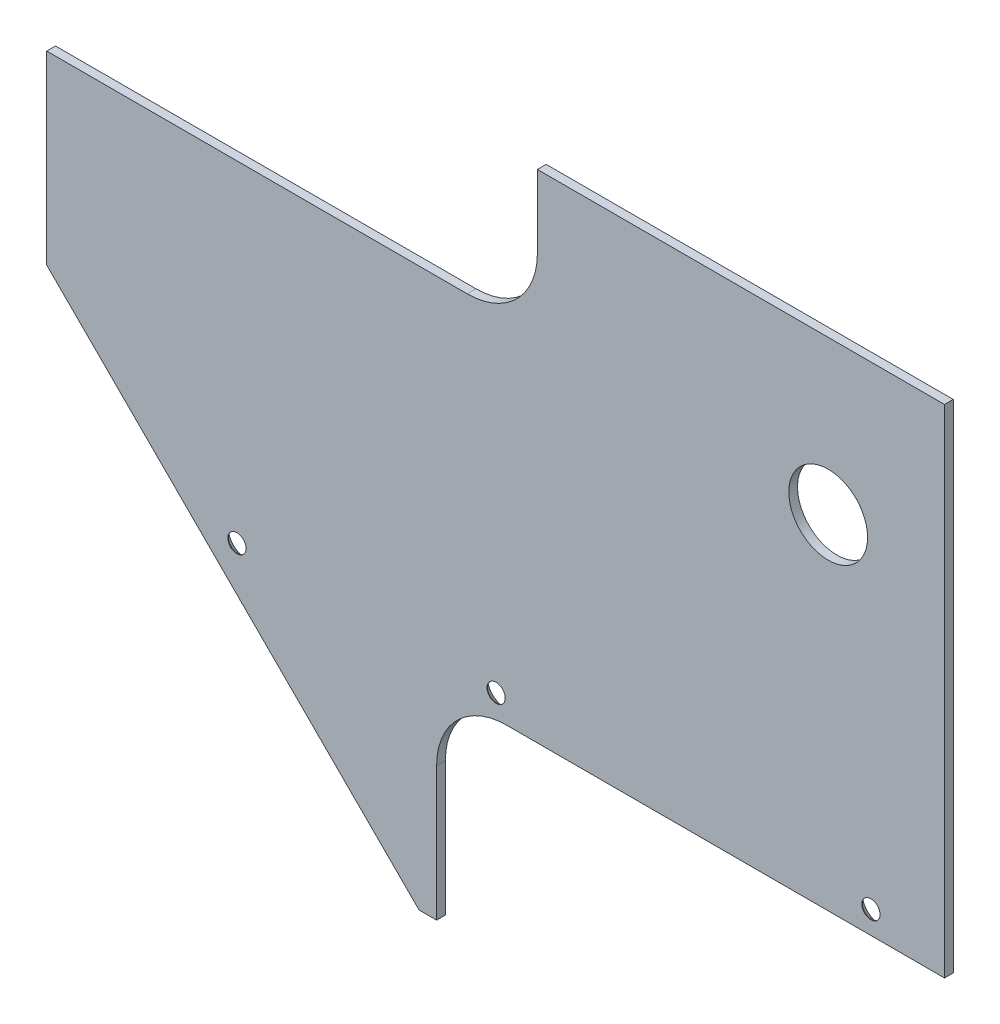
ISO-10303-21;
HEADER;
FILE_DESCRIPTION(('STEP AP214'),'2;1');
FILE_NAME('part.step','',(''),(''),'','','');
FILE_SCHEMA(('AUTOMOTIVE_DESIGN { 1 0 10303 214 1 1 1 1 }'));
ENDSEC;
DATA;
#1=APPLICATION_CONTEXT('core data for automotive mechanical design processes');
#2=APPLICATION_PROTOCOL_DEFINITION('international standard','automotive_design',2000,#1);
#3=PRODUCT_CONTEXT('',#1,'mechanical');
#4=PRODUCT('Part','Part','',(#3));
#5=PRODUCT_RELATED_PRODUCT_CATEGORY('part','',(#4));
#6=PRODUCT_DEFINITION_FORMATION('','',#4);
#7=PRODUCT_DEFINITION_CONTEXT('part definition',#1,'design');
#8=PRODUCT_DEFINITION('design','',#6,#7);
#9=PRODUCT_DEFINITION_SHAPE('','',#8);
#10=(LENGTH_UNIT() NAMED_UNIT(*) SI_UNIT(.MILLI.,.METRE.));
#11=(NAMED_UNIT(*) PLANE_ANGLE_UNIT() SI_UNIT($,.RADIAN.));
#12=(NAMED_UNIT(*) SI_UNIT($,.STERADIAN.) SOLID_ANGLE_UNIT());
#13=UNCERTAINTY_MEASURE_WITH_UNIT(LENGTH_MEASURE(1.E-05),#10,'distance_accuracy_value','');
#14=(GEOMETRIC_REPRESENTATION_CONTEXT(3) GLOBAL_UNCERTAINTY_ASSIGNED_CONTEXT((#13)) GLOBAL_UNIT_ASSIGNED_CONTEXT((#10,
#11,#12)) REPRESENTATION_CONTEXT('',''));
#15=CARTESIAN_POINT('',(0.,0.,0.));
#16=DIRECTION('',(0.,0.,1.));
#17=DIRECTION('',(1.,0.,0.));
#18=AXIS2_PLACEMENT_3D('',#15,#16,#17);
#19=CARTESIAN_POINT('',(0.,0.,3.175));
#20=DIRECTION('',(0.,0.,-1.));
#21=DIRECTION('',(-1.,0.,0.));
#22=AXIS2_PLACEMENT_3D('',#19,#20,#21);
#23=PLANE('',#22);
#24=CARTESIAN_POINT('',(196.040627804405,-39.3145242569452,3.175));
#25=DIRECTION('',(0.,0.,-1.));
#26=DIRECTION('',(-1.,0.,0.));
#27=AXIS2_PLACEMENT_3D('',#24,#25,#26);
#28=CIRCLE('',#27,3.3);
#29=CARTESIAN_POINT('',(192.740627804405,-39.3145242569452,3.175));
#30=VERTEX_POINT('',#29);
#31=EDGE_CURVE('E293',#30,#30,#28,.T.);
#32=ORIENTED_EDGE('',*,*,#31,.T.);
#33=EDGE_LOOP('',(#32));
#34=FACE_BOUND('',#33,.T.);
#35=CARTESIAN_POINT('',(60.1506278044051,-39.3145242569452,3.175));
#36=DIRECTION('',(0.,0.,-1.));
#37=DIRECTION('',(-1.,0.,0.));
#38=AXIS2_PLACEMENT_3D('',#35,#36,#37);
#39=CIRCLE('',#38,3.3);
#40=CARTESIAN_POINT('',(56.8506278044051,-39.3145242569452,3.175));
#41=VERTEX_POINT('',#40);
#42=EDGE_CURVE('E301',#41,#41,#39,.T.);
#43=ORIENTED_EDGE('',*,*,#42,.T.);
#44=EDGE_LOOP('',(#43));
#45=FACE_BOUND('',#44,.T.);
#46=CARTESIAN_POINT('',(-33.8293721955949,-39.3145242569452,3.175));
#47=DIRECTION('',(0.,0.,-1.));
#48=DIRECTION('',(-1.,0.,0.));
#49=AXIS2_PLACEMENT_3D('',#46,#47,#48);
#50=CIRCLE('',#49,3.3);
#51=CARTESIAN_POINT('',(-37.1293721955949,-39.3145242569452,3.175));
#52=VERTEX_POINT('',#51);
#53=EDGE_CURVE('E235',#52,#52,#50,.T.);
#54=ORIENTED_EDGE('',*,*,#53,.T.);
#55=EDGE_LOOP('',(#54));
#56=FACE_BOUND('',#55,.T.);
#57=CARTESIAN_POINT('',(180.538014077677,76.8319757430551,3.175));
#58=DIRECTION('',(0.,0.,1.));
#59=DIRECTION('',(1.,0.,0.));
#60=AXIS2_PLACEMENT_3D('',#57,#58,#59);
#61=CIRCLE('',#60,14.2875);
#62=CARTESIAN_POINT('',(194.825514077677,76.8319757430551,3.175));
#63=VERTEX_POINT('',#62);
#64=EDGE_CURVE('E141',#63,#63,#61,.T.);
#65=ORIENTED_EDGE('',*,*,#64,.F.);
#66=EDGE_LOOP('',(#65));
#67=FACE_BOUND('',#66,.T.);
#68=DIRECTION('',(1.,0.,0.));
#69=VECTOR('',#68,1.);
#70=CARTESIAN_POINT('',(-138.259383473898,80.7414870213568,3.175));
#71=LINE('',#70,#69);
#72=CARTESIAN_POINT('',(-102.790372195595,80.7414870213568,3.175));
#73=VERTEX_POINT('',#72);
#74=CARTESIAN_POINT('',(49.7006165261018,80.7414870213568,3.175));
#75=VERTEX_POINT('',#74);
#76=EDGE_CURVE('E190',#73,#75,#71,.T.);
#77=ORIENTED_EDGE('',*,*,#76,.F.);
#78=DIRECTION('',(0.,1.,0.));
#79=VECTOR('',#78,1.);
#80=CARTESIAN_POINT('',(-102.790372195595,87.7510097784921,3.175));
#81=LINE('',#80,#79);
#82=CARTESIAN_POINT('',(-102.790372195595,13.5224757430543,3.175));
#83=VERTEX_POINT('',#82);
#84=EDGE_CURVE('E48',#83,#73,#81,.T.);
#85=ORIENTED_EDGE('',*,*,#84,.F.);
#86=DIRECTION('',(0.707106781186546,-0.707106781186549,0.));
#87=VECTOR('',#86,1.);
#88=CARTESIAN_POINT('',(-138.259383473896,48.9914870213584,3.175));
#89=LINE('',#88,#87);
#90=CARTESIAN_POINT('',(32.2106278044069,-121.478524256945,3.175));
#91=VERTEX_POINT('',#90);
#92=EDGE_CURVE('E127',#83,#91,#89,.T.);
#93=ORIENTED_EDGE('',*,*,#92,.T.);
#94=DIRECTION('',(1.,0.,0.));
#95=VECTOR('',#94,1.);
#96=CARTESIAN_POINT('',(32.2106278044069,-121.478524256945,3.175));
#97=LINE('',#96,#95);
#98=CARTESIAN_POINT('',(38.5606278044052,-121.478524256945,3.175));
#99=VERTEX_POINT('',#98);
#100=EDGE_CURVE('E148',#91,#99,#97,.T.);
#101=ORIENTED_EDGE('',*,*,#100,.T.);
#102=DIRECTION('',(0.,1.,0.));
#103=VECTOR('',#102,1.);
#104=CARTESIAN_POINT('',(38.5606278044052,-121.478524256947,3.175));
#105=LINE('',#104,#103);
#106=CARTESIAN_POINT('',(38.5606278044053,-72.9645242569452,3.175));
#107=VERTEX_POINT('',#106);
#108=EDGE_CURVE('E185',#99,#107,#105,.T.);
#109=ORIENTED_EDGE('',*,*,#108,.T.);
#110=CARTESIAN_POINT('',(63.9606278044052,-72.9645242569452,3.175));
#111=DIRECTION('',(0.,0.,-1.));
#112=DIRECTION('',(-1.,0.,0.));
#113=AXIS2_PLACEMENT_3D('',#110,#111,#112);
#114=CIRCLE('',#113,25.4);
#115=CARTESIAN_POINT('',(63.9606278044053,-47.5645242569452,3.175));
#116=VERTEX_POINT('',#115);
#117=EDGE_CURVE('E156',#107,#116,#114,.T.);
#118=ORIENTED_EDGE('',*,*,#117,.T.);
#119=DIRECTION('',(-1.,0.,0.));
#120=VECTOR('',#119,1.);
#121=CARTESIAN_POINT('',(222.763434162284,-47.5645242569452,3.175));
#122=LINE('',#121,#120);
#123=CARTESIAN_POINT('',(222.710627804405,-47.5645242569452,3.175));
#124=VERTEX_POINT('',#123);
#125=EDGE_CURVE('E182',#124,#116,#122,.T.);
#126=ORIENTED_EDGE('',*,*,#125,.F.);
#127=DIRECTION('',(0.,1.,0.));
#128=VECTOR('',#127,1.);
#129=CARTESIAN_POINT('',(222.710627804405,-121.478524256948,3.175));
#130=LINE('',#129,#128);
#131=CARTESIAN_POINT('',(222.710627804405,132.521475743053,3.175));
#132=VERTEX_POINT('',#131);
#133=EDGE_CURVE('E138',#124,#132,#130,.T.);
#134=ORIENTED_EDGE('',*,*,#133,.T.);
#135=DIRECTION('',(1.,0.,0.));
#136=VECTOR('',#135,1.);
#137=CARTESIAN_POINT('',(75.1006165261018,132.521475743053,3.175));
#138=LINE('',#137,#136);
#139=CARTESIAN_POINT('',(75.1006165261018,132.521475743053,3.175));
#140=VERTEX_POINT('',#139);
#141=EDGE_CURVE('E233',#140,#132,#138,.T.);
#142=ORIENTED_EDGE('',*,*,#141,.F.);
#143=DIRECTION('',(0.,-1.,0.));
#144=VECTOR('',#143,1.);
#145=CARTESIAN_POINT('',(75.1006165261018,145.221475743053,3.175));
#146=LINE('',#145,#144);
#147=CARTESIAN_POINT('',(75.1006165261018,106.141487021357,3.175));
#148=VERTEX_POINT('',#147);
#149=EDGE_CURVE('E180',#140,#148,#146,.T.);
#150=ORIENTED_EDGE('',*,*,#149,.T.);
#151=CARTESIAN_POINT('',(49.7006165261018,106.141487021357,3.175));
#152=DIRECTION('',(0.,0.,-1.));
#153=DIRECTION('',(-1.,0.,0.));
#154=AXIS2_PLACEMENT_3D('',#151,#152,#153);
#155=CIRCLE('',#154,25.4);
#156=EDGE_CURVE('E166',#148,#75,#155,.T.);
#157=ORIENTED_EDGE('',*,*,#156,.T.);
#158=EDGE_LOOP('',(#77,#85,#93,#101,#109,#118,#126,#134,#142,#150,#157));
#159=FACE_BOUND('',#158,.T.);
#160=ADVANCED_FACE('F33',(#34,#45,#56,#67,#159),#23,.F.);
#161=CARTESIAN_POINT('',(0.,0.,0.));
#162=DIRECTION('',(0.,0.,-1.));
#163=DIRECTION('',(-1.,0.,0.));
#164=AXIS2_PLACEMENT_3D('',#161,#162,#163);
#165=PLANE('',#164);
#166=DIRECTION('',(0.,1.,0.));
#167=VECTOR('',#166,1.);
#168=CARTESIAN_POINT('',(-102.790372195595,87.7510097784921,0.));
#169=LINE('',#168,#167);
#170=CARTESIAN_POINT('',(-102.790372195595,13.5224757430543,0.));
#171=VERTEX_POINT('',#170);
#172=CARTESIAN_POINT('',(-102.790372195595,80.7414870213568,0.));
#173=VERTEX_POINT('',#172);
#174=EDGE_CURVE('E113',#171,#173,#169,.T.);
#175=ORIENTED_EDGE('',*,*,#174,.T.);
#176=DIRECTION('',(1.,0.,0.));
#177=VECTOR('',#176,1.);
#178=CARTESIAN_POINT('',(-138.259383473898,80.7414870213568,0.));
#179=LINE('',#178,#177);
#180=CARTESIAN_POINT('',(49.7006165261018,80.7414870213568,0.));
#181=VERTEX_POINT('',#180);
#182=EDGE_CURVE('E173',#173,#181,#179,.T.);
#183=ORIENTED_EDGE('',*,*,#182,.T.);
#184=CARTESIAN_POINT('',(49.7006165261018,106.141487021357,0.));
#185=DIRECTION('',(0.,0.,-1.));
#186=DIRECTION('',(-1.,0.,0.));
#187=AXIS2_PLACEMENT_3D('',#184,#185,#186);
#188=CIRCLE('',#187,25.4);
#189=CARTESIAN_POINT('',(75.1006165261018,106.141487021357,0.));
#190=VERTEX_POINT('',#189);
#191=EDGE_CURVE('E41',#181,#190,#188,.F.);
#192=ORIENTED_EDGE('',*,*,#191,.T.);
#193=DIRECTION('',(0.,-1.,0.));
#194=VECTOR('',#193,1.);
#195=CARTESIAN_POINT('',(75.1006165261018,145.221475743053,0.));
#196=LINE('',#195,#194);
#197=CARTESIAN_POINT('',(75.1006165261018,132.521475743053,0.));
#198=VERTEX_POINT('',#197);
#199=EDGE_CURVE('E172',#198,#190,#196,.T.);
#200=ORIENTED_EDGE('',*,*,#199,.F.);
#201=DIRECTION('',(1.,0.,0.));
#202=VECTOR('',#201,1.);
#203=CARTESIAN_POINT('',(75.1006165261018,132.521475743053,0.));
#204=LINE('',#203,#202);
#205=CARTESIAN_POINT('',(222.710627804405,132.521475743053,0.));
#206=VERTEX_POINT('',#205);
#207=EDGE_CURVE('E55',#198,#206,#204,.T.);
#208=ORIENTED_EDGE('',*,*,#207,.T.);
#209=DIRECTION('',(0.,1.,0.));
#210=VECTOR('',#209,1.);
#211=CARTESIAN_POINT('',(222.710627804405,-121.478524256948,0.));
#212=LINE('',#211,#210);
#213=CARTESIAN_POINT('',(222.710627804405,-47.5645242569452,0.));
#214=VERTEX_POINT('',#213);
#215=EDGE_CURVE('E136',#214,#206,#212,.T.);
#216=ORIENTED_EDGE('',*,*,#215,.F.);
#217=DIRECTION('',(-1.,0.,0.));
#218=VECTOR('',#217,1.);
#219=CARTESIAN_POINT('',(222.763434162284,-47.5645242569452,0.));
#220=LINE('',#219,#218);
#221=CARTESIAN_POINT('',(63.9606278044053,-47.5645242569452,0.));
#222=VERTEX_POINT('',#221);
#223=EDGE_CURVE('E194',#214,#222,#220,.T.);
#224=ORIENTED_EDGE('',*,*,#223,.T.);
#225=CARTESIAN_POINT('',(63.9606278044052,-72.9645242569452,0.));
#226=DIRECTION('',(0.,0.,-1.));
#227=DIRECTION('',(-1.,0.,0.));
#228=AXIS2_PLACEMENT_3D('',#225,#226,#227);
#229=CIRCLE('',#228,25.4);
#230=CARTESIAN_POINT('',(38.5606278044053,-72.9645242569452,0.));
#231=VERTEX_POINT('',#230);
#232=EDGE_CURVE('E158',#222,#231,#229,.F.);
#233=ORIENTED_EDGE('',*,*,#232,.T.);
#234=DIRECTION('',(0.,1.,0.));
#235=VECTOR('',#234,1.);
#236=CARTESIAN_POINT('',(38.5606278044052,-121.478524256947,0.));
#237=LINE('',#236,#235);
#238=CARTESIAN_POINT('',(38.5606278044052,-121.478524256947,0.));
#239=VERTEX_POINT('',#238);
#240=EDGE_CURVE('E197',#239,#231,#237,.T.);
#241=ORIENTED_EDGE('',*,*,#240,.F.);
#242=DIRECTION('',(1.,0.,0.));
#243=VECTOR('',#242,1.);
#244=CARTESIAN_POINT('',(32.2106278044069,-121.478524256945,0.));
#245=LINE('',#244,#243);
#246=CARTESIAN_POINT('',(32.2106278044069,-121.478524256945,0.));
#247=VERTEX_POINT('',#246);
#248=EDGE_CURVE('E135',#247,#239,#245,.T.);
#249=ORIENTED_EDGE('',*,*,#248,.F.);
#250=DIRECTION('',(0.707106781186546,-0.707106781186549,0.));
#251=VECTOR('',#250,1.);
#252=CARTESIAN_POINT('',(-138.259383473896,48.9914870213584,0.));
#253=LINE('',#252,#251);
#254=EDGE_CURVE('E125',#171,#247,#253,.T.);
#255=ORIENTED_EDGE('',*,*,#254,.F.);
#256=EDGE_LOOP('',(#175,#183,#192,#200,#208,#216,#224,#233,#241,#249,#255));
#257=FACE_BOUND('',#256,.T.);
#258=CARTESIAN_POINT('',(196.040627804405,-39.3145242569452,0.));
#259=DIRECTION('',(0.,0.,-1.));
#260=DIRECTION('',(-1.,0.,0.));
#261=AXIS2_PLACEMENT_3D('',#258,#259,#260);
#262=CIRCLE('',#261,6.3);
#263=CARTESIAN_POINT('',(189.740627804405,-39.3145242569452,0.));
#264=VERTEX_POINT('',#263);
#265=EDGE_CURVE('E128',#264,#264,#262,.T.);
#266=ORIENTED_EDGE('',*,*,#265,.F.);
#267=EDGE_LOOP('',(#266));
#268=FACE_BOUND('',#267,.T.);
#269=CARTESIAN_POINT('',(60.1506278044051,-39.3145242569452,0.));
#270=DIRECTION('',(0.,0.,-1.));
#271=DIRECTION('',(-1.,0.,0.));
#272=AXIS2_PLACEMENT_3D('',#269,#270,#271);
#273=CIRCLE('',#272,6.3);
#274=CARTESIAN_POINT('',(53.8506278044051,-39.3145242569452,0.));
#275=VERTEX_POINT('',#274);
#276=EDGE_CURVE('E295',#275,#275,#273,.T.);
#277=ORIENTED_EDGE('',*,*,#276,.F.);
#278=EDGE_LOOP('',(#277));
#279=FACE_BOUND('',#278,.T.);
#280=CARTESIAN_POINT('',(-33.8293721955949,-39.3145242569452,0.));
#281=DIRECTION('',(0.,0.,-1.));
#282=DIRECTION('',(-1.,0.,0.));
#283=AXIS2_PLACEMENT_3D('',#280,#281,#282);
#284=CIRCLE('',#283,6.3);
#285=CARTESIAN_POINT('',(-40.1293721955949,-39.3145242569452,0.));
#286=VERTEX_POINT('',#285);
#287=EDGE_CURVE('E304',#286,#286,#284,.T.);
#288=ORIENTED_EDGE('',*,*,#287,.F.);
#289=EDGE_LOOP('',(#288));
#290=FACE_BOUND('',#289,.T.);
#291=CARTESIAN_POINT('',(180.538014077677,76.8319757430551,0.));
#292=DIRECTION('',(0.,0.,1.));
#293=DIRECTION('',(1.,0.,0.));
#294=AXIS2_PLACEMENT_3D('',#291,#292,#293);
#295=CIRCLE('',#294,14.2875);
#296=CARTESIAN_POINT('',(194.825514077677,76.8319757430551,0.));
#297=VERTEX_POINT('',#296);
#298=EDGE_CURVE('E205',#297,#297,#295,.T.);
#299=ORIENTED_EDGE('',*,*,#298,.T.);
#300=EDGE_LOOP('',(#299));
#301=FACE_BOUND('',#300,.T.);
#302=ADVANCED_FACE('F131',(#257,#268,#279,#290,#301),#165,.T.);
#303=CARTESIAN_POINT('',(32.2106278044069,-121.478524256945,3.175));
#304=DIRECTION('',(0.,1.,0.));
#305=DIRECTION('',(-1.,0.,0.));
#306=AXIS2_PLACEMENT_3D('',#303,#304,#305);
#307=PLANE('',#306);
#308=DIRECTION('',(0.,0.,1.));
#309=VECTOR('',#308,1.);
#310=CARTESIAN_POINT('',(38.5606278044052,-121.478524256947,0.));
#311=LINE('',#310,#309);
#312=EDGE_CURVE('E199',#239,#99,#311,.T.);
#313=ORIENTED_EDGE('',*,*,#312,.T.);
#314=ORIENTED_EDGE('',*,*,#100,.F.);
#315=DIRECTION('',(0.,0.,-1.));
#316=VECTOR('',#315,1.);
#317=CARTESIAN_POINT('',(32.2106278044069,-121.478524256945,3.175));
#318=LINE('',#317,#316);
#319=EDGE_CURVE('E145',#91,#247,#318,.T.);
#320=ORIENTED_EDGE('',*,*,#319,.T.);
#321=ORIENTED_EDGE('',*,*,#248,.T.);
#322=EDGE_LOOP('',(#313,#314,#320,#321));
#323=FACE_BOUND('',#322,.T.);
#324=ADVANCED_FACE('F217',(#323),#307,.F.);
#325=CARTESIAN_POINT('',(222.710627804405,-121.478524256948,3.175));
#326=DIRECTION('',(-1.,0.,0.));
#327=DIRECTION('',(0.,-1.,0.));
#328=AXIS2_PLACEMENT_3D('',#325,#326,#327);
#329=PLANE('',#328);
#330=ORIENTED_EDGE('',*,*,#215,.T.);
#331=DIRECTION('',(0.,0.,1.));
#332=VECTOR('',#331,1.);
#333=CARTESIAN_POINT('',(222.710627804405,132.521475743053,0.));
#334=LINE('',#333,#332);
#335=EDGE_CURVE('E192',#206,#132,#334,.T.);
#336=ORIENTED_EDGE('',*,*,#335,.T.);
#337=ORIENTED_EDGE('',*,*,#133,.F.);
#338=DIRECTION('',(0.,0.,-1.));
#339=VECTOR('',#338,1.);
#340=CARTESIAN_POINT('',(222.710627804405,-47.5645242569452,3.175));
#341=LINE('',#340,#339);
#342=EDGE_CURVE('E147',#124,#214,#341,.T.);
#343=ORIENTED_EDGE('',*,*,#342,.T.);
#344=EDGE_LOOP('',(#330,#336,#337,#343));
#345=FACE_BOUND('',#344,.T.);
#346=ADVANCED_FACE('F231',(#345),#329,.F.);
#347=CARTESIAN_POINT('',(-138.259383473896,48.9914870213584,3.175));
#348=DIRECTION('',(0.707106781186549,0.707106781186546,0.));
#349=DIRECTION('',(-0.707106781186546,0.707106781186549,0.));
#350=AXIS2_PLACEMENT_3D('',#347,#348,#349);
#351=PLANE('',#350);
#352=ORIENTED_EDGE('',*,*,#92,.F.);
#353=DIRECTION('',(0.,0.,1.));
#354=VECTOR('',#353,1.);
#355=CARTESIAN_POINT('',(-102.790372195595,13.5224757430543,0.));
#356=LINE('',#355,#354);
#357=EDGE_CURVE('E116',#171,#83,#356,.T.);
#358=ORIENTED_EDGE('',*,*,#357,.F.);
#359=ORIENTED_EDGE('',*,*,#254,.T.);
#360=ORIENTED_EDGE('',*,*,#319,.F.);
#361=EDGE_LOOP('',(#352,#358,#359,#360));
#362=FACE_BOUND('',#361,.T.);
#363=ADVANCED_FACE('F123',(#362),#351,.F.);
#364=CARTESIAN_POINT('',(180.538014077677,76.8319757430551,3.175));
#365=DIRECTION('',(0.,0.,-1.));
#366=DIRECTION('',(-1.,0.,0.));
#367=AXIS2_PLACEMENT_3D('',#364,#365,#366);
#368=CYLINDRICAL_SURFACE('',#367,14.2875);
#369=ORIENTED_EDGE('',*,*,#64,.T.);
#370=EDGE_LOOP('',(#369));
#371=FACE_BOUND('',#370,.T.);
#372=ORIENTED_EDGE('',*,*,#298,.F.);
#373=EDGE_LOOP('',(#372));
#374=FACE_BOUND('',#373,.T.);
#375=ADVANCED_FACE('F264',(#371,#374),#368,.F.);
#376=CARTESIAN_POINT('',(222.763434162284,-47.5645242569452,0.));
#377=DIRECTION('',(0.,1.,0.));
#378=DIRECTION('',(-1.,0.,0.));
#379=AXIS2_PLACEMENT_3D('',#376,#377,#378);
#380=PLANE('',#379);
#381=ORIENTED_EDGE('',*,*,#125,.T.);
#382=DIRECTION('',(0.,0.,1.));
#383=VECTOR('',#382,1.);
#384=CARTESIAN_POINT('',(63.9606278044053,-47.5645242569452,0.));
#385=LINE('',#384,#383);
#386=EDGE_CURVE('E154',#116,#222,#385,.F.);
#387=ORIENTED_EDGE('',*,*,#386,.T.);
#388=ORIENTED_EDGE('',*,*,#223,.F.);
#389=ORIENTED_EDGE('',*,*,#342,.F.);
#390=EDGE_LOOP('',(#381,#387,#388,#389));
#391=FACE_BOUND('',#390,.T.);
#392=ADVANCED_FACE('F229',(#391),#380,.F.);
#393=CARTESIAN_POINT('',(38.5606278044052,-121.478524256947,0.));
#394=DIRECTION('',(1.,0.,0.));
#395=DIRECTION('',(0.,1.,0.));
#396=AXIS2_PLACEMENT_3D('',#393,#394,#395);
#397=PLANE('',#396);
#398=ORIENTED_EDGE('',*,*,#240,.T.);
#399=DIRECTION('',(0.,0.,1.));
#400=VECTOR('',#399,1.);
#401=CARTESIAN_POINT('',(38.5606278044053,-72.9645242569452,0.));
#402=LINE('',#401,#400);
#403=EDGE_CURVE('E151',#231,#107,#402,.T.);
#404=ORIENTED_EDGE('',*,*,#403,.T.);
#405=ORIENTED_EDGE('',*,*,#108,.F.);
#406=ORIENTED_EDGE('',*,*,#312,.F.);
#407=EDGE_LOOP('',(#398,#404,#405,#406));
#408=FACE_BOUND('',#407,.T.);
#409=ADVANCED_FACE('F219',(#408),#397,.T.);
#410=CARTESIAN_POINT('',(63.9606278044052,-72.9645242569452,0.));
#411=DIRECTION('',(0.,0.,1.));
#412=DIRECTION('',(1.,0.,0.));
#413=AXIS2_PLACEMENT_3D('',#410,#411,#412);
#414=CYLINDRICAL_SURFACE('',#413,25.4);
#415=ORIENTED_EDGE('',*,*,#232,.F.);
#416=ORIENTED_EDGE('',*,*,#386,.F.);
#417=ORIENTED_EDGE('',*,*,#117,.F.);
#418=ORIENTED_EDGE('',*,*,#403,.F.);
#419=EDGE_LOOP('',(#415,#416,#417,#418));
#420=FACE_BOUND('',#419,.T.);
#421=ADVANCED_FACE('F225',(#420),#414,.F.);
#422=CARTESIAN_POINT('',(75.1006165261018,145.221475743053,0.));
#423=DIRECTION('',(-1.,0.,0.));
#424=DIRECTION('',(0.,0.,1.));
#425=AXIS2_PLACEMENT_3D('',#422,#423,#424);
#426=PLANE('',#425);
#427=DIRECTION('',(0.,0.,1.));
#428=VECTOR('',#427,1.);
#429=CARTESIAN_POINT('',(75.1006165261018,132.521475743053,0.));
#430=LINE('',#429,#428);
#431=EDGE_CURVE('E181',#198,#140,#430,.T.);
#432=ORIENTED_EDGE('',*,*,#431,.F.);
#433=ORIENTED_EDGE('',*,*,#199,.T.);
#434=DIRECTION('',(0.,0.,1.));
#435=VECTOR('',#434,1.);
#436=CARTESIAN_POINT('',(75.1006165261018,106.141487021357,0.));
#437=LINE('',#436,#435);
#438=EDGE_CURVE('E163',#190,#148,#437,.T.);
#439=ORIENTED_EDGE('',*,*,#438,.T.);
#440=ORIENTED_EDGE('',*,*,#149,.F.);
#441=EDGE_LOOP('',(#432,#433,#439,#440));
#442=FACE_BOUND('',#441,.T.);
#443=ADVANCED_FACE('F179',(#442),#426,.T.);
#444=CARTESIAN_POINT('',(-138.259383473898,80.7414870213568,0.));
#445=DIRECTION('',(0.,-1.,0.));
#446=DIRECTION('',(0.,0.,-1.));
#447=AXIS2_PLACEMENT_3D('',#444,#445,#446);
#448=PLANE('',#447);
#449=ORIENTED_EDGE('',*,*,#182,.F.);
#450=DIRECTION('',(0.,0.,1.));
#451=VECTOR('',#450,1.);
#452=CARTESIAN_POINT('',(-102.790372195595,80.7414870213568,0.));
#453=LINE('',#452,#451);
#454=EDGE_CURVE('E11',#173,#73,#453,.T.);
#455=ORIENTED_EDGE('',*,*,#454,.T.);
#456=ORIENTED_EDGE('',*,*,#76,.T.);
#457=DIRECTION('',(0.,0.,1.));
#458=VECTOR('',#457,1.);
#459=CARTESIAN_POINT('',(49.7006165261018,80.7414870213568,0.));
#460=LINE('',#459,#458);
#461=EDGE_CURVE('E160',#75,#181,#460,.F.);
#462=ORIENTED_EDGE('',*,*,#461,.T.);
#463=EDGE_LOOP('',(#449,#455,#456,#462));
#464=FACE_BOUND('',#463,.T.);
#465=ADVANCED_FACE('F252',(#464),#448,.F.);
#466=CARTESIAN_POINT('',(49.7006165261018,106.141487021357,0.));
#467=DIRECTION('',(0.,0.,1.));
#468=DIRECTION('',(1.,0.,0.));
#469=AXIS2_PLACEMENT_3D('',#466,#467,#468);
#470=CYLINDRICAL_SURFACE('',#469,25.4);
#471=ORIENTED_EDGE('',*,*,#191,.F.);
#472=ORIENTED_EDGE('',*,*,#461,.F.);
#473=ORIENTED_EDGE('',*,*,#156,.F.);
#474=ORIENTED_EDGE('',*,*,#438,.F.);
#475=EDGE_LOOP('',(#471,#472,#473,#474));
#476=FACE_BOUND('',#475,.T.);
#477=ADVANCED_FACE('F35',(#476),#470,.F.);
#478=CARTESIAN_POINT('',(75.1006165261018,132.521475743053,0.));
#479=DIRECTION('',(0.,-1.,0.));
#480=DIRECTION('',(0.,0.,-1.));
#481=AXIS2_PLACEMENT_3D('',#478,#479,#480);
#482=PLANE('',#481);
#483=ORIENTED_EDGE('',*,*,#141,.T.);
#484=ORIENTED_EDGE('',*,*,#335,.F.);
#485=ORIENTED_EDGE('',*,*,#207,.F.);
#486=ORIENTED_EDGE('',*,*,#431,.T.);
#487=EDGE_LOOP('',(#483,#484,#485,#486));
#488=FACE_BOUND('',#487,.T.);
#489=ADVANCED_FACE('F241',(#488),#482,.F.);
#490=CARTESIAN_POINT('',(-33.8293721955949,-39.3145242569452,0.));
#491=DIRECTION('',(0.,0.,-1.));
#492=DIRECTION('',(-1.,0.,0.));
#493=AXIS2_PLACEMENT_3D('',#490,#491,#492);
#494=CYLINDRICAL_SURFACE('',#493,3.3);
#495=ORIENTED_EDGE('',*,*,#53,.F.);
#496=EDGE_LOOP('',(#495));
#497=FACE_BOUND('',#496,.T.);
#498=CARTESIAN_POINT('',(-33.8293721955949,-39.3145242569452,3.));
#499=DIRECTION('',(0.,0.,-1.));
#500=DIRECTION('',(-1.,0.,0.));
#501=AXIS2_PLACEMENT_3D('',#498,#499,#500);
#502=CIRCLE('',#501,3.3);
#503=CARTESIAN_POINT('',(-37.1293721955949,-39.3145242569452,3.));
#504=VERTEX_POINT('',#503);
#505=EDGE_CURVE('E306',#504,#504,#502,.T.);
#506=ORIENTED_EDGE('',*,*,#505,.T.);
#507=EDGE_LOOP('',(#506));
#508=FACE_BOUND('',#507,.T.);
#509=ADVANCED_FACE('F243',(#497,#508),#494,.F.);
#510=CARTESIAN_POINT('',(-33.8293721955949,-39.3145242569452,0.));
#511=DIRECTION('',(0.,0.,-1.));
#512=DIRECTION('',(-1.,0.,0.));
#513=AXIS2_PLACEMENT_3D('',#510,#511,#512);
#514=CONICAL_SURFACE('',#513,6.3,0.785398163397449);
#515=ORIENTED_EDGE('',*,*,#505,.F.);
#516=EDGE_LOOP('',(#515));
#517=FACE_BOUND('',#516,.T.);
#518=ORIENTED_EDGE('',*,*,#287,.T.);
#519=EDGE_LOOP('',(#518));
#520=FACE_BOUND('',#519,.T.);
#521=ADVANCED_FACE('F249',(#517,#520),#514,.F.);
#522=CARTESIAN_POINT('',(60.1506278044051,-39.3145242569452,0.));
#523=DIRECTION('',(0.,0.,-1.));
#524=DIRECTION('',(-1.,0.,0.));
#525=AXIS2_PLACEMENT_3D('',#522,#523,#524);
#526=CYLINDRICAL_SURFACE('',#525,3.3);
#527=ORIENTED_EDGE('',*,*,#42,.F.);
#528=EDGE_LOOP('',(#527));
#529=FACE_BOUND('',#528,.T.);
#530=CARTESIAN_POINT('',(60.1506278044051,-39.3145242569452,3.));
#531=DIRECTION('',(0.,0.,-1.));
#532=DIRECTION('',(-1.,0.,0.));
#533=AXIS2_PLACEMENT_3D('',#530,#531,#532);
#534=CIRCLE('',#533,3.3);
#535=CARTESIAN_POINT('',(56.8506278044051,-39.3145242569452,3.));
#536=VERTEX_POINT('',#535);
#537=EDGE_CURVE('E298',#536,#536,#534,.T.);
#538=ORIENTED_EDGE('',*,*,#537,.T.);
#539=EDGE_LOOP('',(#538));
#540=FACE_BOUND('',#539,.T.);
#541=ADVANCED_FACE('F380',(#529,#540),#526,.F.);
#542=CARTESIAN_POINT('',(60.1506278044051,-39.3145242569452,0.));
#543=DIRECTION('',(0.,0.,-1.));
#544=DIRECTION('',(-1.,0.,0.));
#545=AXIS2_PLACEMENT_3D('',#542,#543,#544);
#546=CONICAL_SURFACE('',#545,6.3,0.785398163397449);
#547=ORIENTED_EDGE('',*,*,#537,.F.);
#548=EDGE_LOOP('',(#547));
#549=FACE_BOUND('',#548,.T.);
#550=ORIENTED_EDGE('',*,*,#276,.T.);
#551=EDGE_LOOP('',(#550));
#552=FACE_BOUND('',#551,.T.);
#553=ADVANCED_FACE('F390',(#549,#552),#546,.F.);
#554=CARTESIAN_POINT('',(196.040627804405,-39.3145242569452,0.));
#555=DIRECTION('',(0.,0.,-1.));
#556=DIRECTION('',(-1.,0.,0.));
#557=AXIS2_PLACEMENT_3D('',#554,#555,#556);
#558=CYLINDRICAL_SURFACE('',#557,3.3);
#559=ORIENTED_EDGE('',*,*,#31,.F.);
#560=EDGE_LOOP('',(#559));
#561=FACE_BOUND('',#560,.T.);
#562=CARTESIAN_POINT('',(196.040627804405,-39.3145242569452,3.));
#563=DIRECTION('',(0.,0.,-1.));
#564=DIRECTION('',(-1.,0.,0.));
#565=AXIS2_PLACEMENT_3D('',#562,#563,#564);
#566=CIRCLE('',#565,3.3);
#567=CARTESIAN_POINT('',(192.740627804405,-39.3145242569452,3.));
#568=VERTEX_POINT('',#567);
#569=EDGE_CURVE('E290',#568,#568,#566,.T.);
#570=ORIENTED_EDGE('',*,*,#569,.T.);
#571=EDGE_LOOP('',(#570));
#572=FACE_BOUND('',#571,.T.);
#573=ADVANCED_FACE('F400',(#561,#572),#558,.F.);
#574=CARTESIAN_POINT('',(196.040627804405,-39.3145242569452,0.));
#575=DIRECTION('',(0.,0.,-1.));
#576=DIRECTION('',(-1.,0.,0.));
#577=AXIS2_PLACEMENT_3D('',#574,#575,#576);
#578=CONICAL_SURFACE('',#577,6.3,0.785398163397449);
#579=ORIENTED_EDGE('',*,*,#569,.F.);
#580=EDGE_LOOP('',(#579));
#581=FACE_BOUND('',#580,.T.);
#582=ORIENTED_EDGE('',*,*,#265,.T.);
#583=EDGE_LOOP('',(#582));
#584=FACE_BOUND('',#583,.T.);
#585=ADVANCED_FACE('F410',(#581,#584),#578,.F.);
#586=CARTESIAN_POINT('',(-102.790372195595,87.7510097784921,0.));
#587=DIRECTION('',(1.,0.,0.));
#588=DIRECTION('',(0.,0.,-1.));
#589=AXIS2_PLACEMENT_3D('',#586,#587,#588);
#590=PLANE('',#589);
#591=ORIENTED_EDGE('',*,*,#174,.F.);
#592=ORIENTED_EDGE('',*,*,#357,.T.);
#593=ORIENTED_EDGE('',*,*,#84,.T.);
#594=ORIENTED_EDGE('',*,*,#454,.F.);
#595=EDGE_LOOP('',(#591,#592,#593,#594));
#596=FACE_BOUND('',#595,.T.);
#597=ADVANCED_FACE('F115',(#596),#590,.F.);
#598=CLOSED_SHELL('',(#160,#302,#324,#346,#363,#375,#392,#409,#421,#443,#465,#477,#489,#509,
#521,#541,#553,#573,#585,#597));
#599=MANIFOLD_SOLID_BREP('B2',#598);
#600=ADVANCED_BREP_SHAPE_REPRESENTATION('',(#18,#599),#14);
#601=SHAPE_DEFINITION_REPRESENTATION(#9,#600);
ENDSEC;
END-ISO-10303-21;
